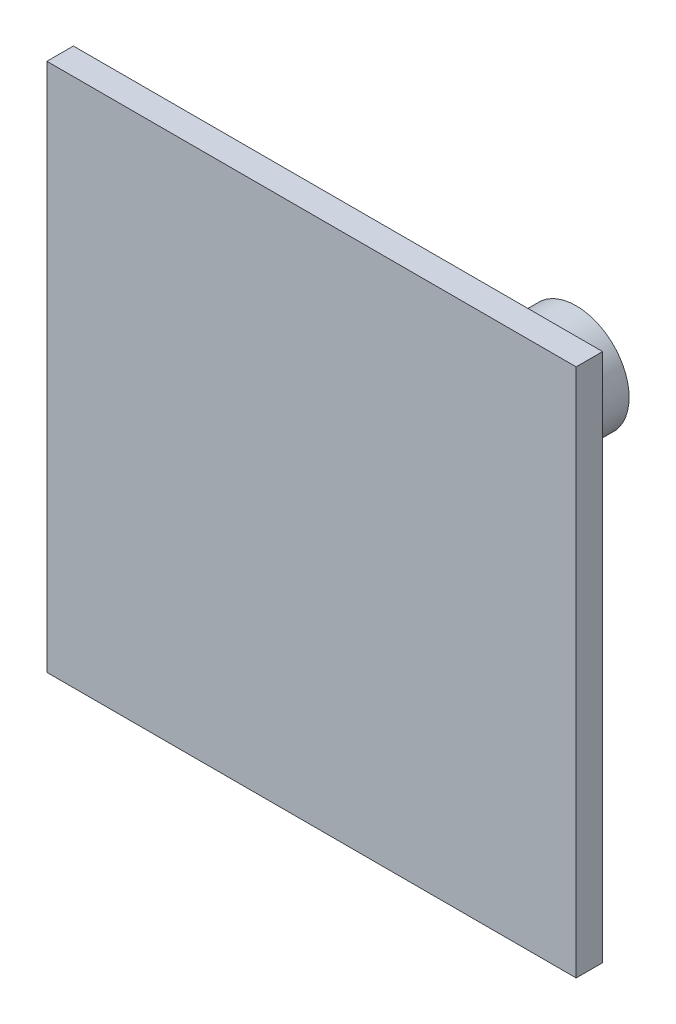
ISO-10303-21;
HEADER;
FILE_DESCRIPTION(('STEP AP214'),'2;1');
FILE_NAME('part.step','',(''),(''),'','','');
FILE_SCHEMA(('AUTOMOTIVE_DESIGN { 1 0 10303 214 1 1 1 1 }'));
ENDSEC;
DATA;
#1=APPLICATION_CONTEXT('core data for automotive mechanical design processes');
#2=APPLICATION_PROTOCOL_DEFINITION('international standard','automotive_design',2000,#1);
#3=PRODUCT_CONTEXT('',#1,'mechanical');
#4=PRODUCT('Part','Part','',(#3));
#5=PRODUCT_RELATED_PRODUCT_CATEGORY('part','',(#4));
#6=PRODUCT_DEFINITION_FORMATION('','',#4);
#7=PRODUCT_DEFINITION_CONTEXT('part definition',#1,'design');
#8=PRODUCT_DEFINITION('design','',#6,#7);
#9=PRODUCT_DEFINITION_SHAPE('','',#8);
#10=(LENGTH_UNIT() NAMED_UNIT(*) SI_UNIT(.MILLI.,.METRE.));
#11=(NAMED_UNIT(*) PLANE_ANGLE_UNIT() SI_UNIT($,.RADIAN.));
#12=(NAMED_UNIT(*) SI_UNIT($,.STERADIAN.) SOLID_ANGLE_UNIT());
#13=UNCERTAINTY_MEASURE_WITH_UNIT(LENGTH_MEASURE(1.E-05),#10,'distance_accuracy_value','');
#14=(GEOMETRIC_REPRESENTATION_CONTEXT(3) GLOBAL_UNCERTAINTY_ASSIGNED_CONTEXT((#13)) GLOBAL_UNIT_ASSIGNED_CONTEXT((#10,
#11,#12)) REPRESENTATION_CONTEXT('',''));
#15=CARTESIAN_POINT('',(0.,0.,0.));
#16=DIRECTION('',(0.,0.,1.));
#17=DIRECTION('',(1.,0.,0.));
#18=AXIS2_PLACEMENT_3D('',#15,#16,#17);
#19=CARTESIAN_POINT('',(-102.425876010782,67.1159029649596,10.));
#20=DIRECTION('',(1.,0.,0.));
#21=DIRECTION('',(0.,1.,0.));
#22=AXIS2_PLACEMENT_3D('',#19,#20,#21);
#23=PLANE('',#22);
#24=DIRECTION('',(0.,-1.,0.));
#25=VECTOR('',#24,1.);
#26=CARTESIAN_POINT('',(-102.425876010782,67.1159029649596,0.));
#27=LINE('',#26,#25);
#28=CARTESIAN_POINT('',(-102.425876010782,67.1159029649596,0.));
#29=VERTEX_POINT('',#28);
#30=CARTESIAN_POINT('',(-102.425876010782,-132.88409703504,0.));
#31=VERTEX_POINT('',#30);
#32=EDGE_CURVE('E110',#29,#31,#27,.T.);
#33=ORIENTED_EDGE('',*,*,#32,.T.);
#34=DIRECTION('',(0.,0.,-1.));
#35=VECTOR('',#34,1.);
#36=CARTESIAN_POINT('',(-102.425876010782,-132.88409703504,10.));
#37=LINE('',#36,#35);
#38=CARTESIAN_POINT('',(-102.425876010782,-132.88409703504,10.));
#39=VERTEX_POINT('',#38);
#40=EDGE_CURVE('E48',#39,#31,#37,.T.);
#41=ORIENTED_EDGE('',*,*,#40,.F.);
#42=DIRECTION('',(0.,-1.,0.));
#43=VECTOR('',#42,1.);
#44=CARTESIAN_POINT('',(-102.425876010782,67.1159029649596,10.));
#45=LINE('',#44,#43);
#46=CARTESIAN_POINT('',(-102.425876010782,67.1159029649596,10.));
#47=VERTEX_POINT('',#46);
#48=EDGE_CURVE('E92',#47,#39,#45,.T.);
#49=ORIENTED_EDGE('',*,*,#48,.F.);
#50=DIRECTION('',(0.,0.,-1.));
#51=VECTOR('',#50,1.);
#52=CARTESIAN_POINT('',(-102.425876010782,67.1159029649596,10.));
#53=LINE('',#52,#51);
#54=EDGE_CURVE('E106',#47,#29,#53,.T.);
#55=ORIENTED_EDGE('',*,*,#54,.T.);
#56=EDGE_LOOP('',(#33,#41,#49,#55));
#57=FACE_BOUND('',#56,.T.);
#58=ADVANCED_FACE('F39',(#57),#23,.F.);
#59=CARTESIAN_POINT('',(-102.425876010782,-132.88409703504,10.));
#60=DIRECTION('',(0.,1.,0.));
#61=DIRECTION('',(0.,0.,1.));
#62=AXIS2_PLACEMENT_3D('',#59,#60,#61);
#63=PLANE('',#62);
#64=DIRECTION('',(1.,0.,0.));
#65=VECTOR('',#64,1.);
#66=CARTESIAN_POINT('',(-102.425876010782,-132.88409703504,0.));
#67=LINE('',#66,#65);
#68=CARTESIAN_POINT('',(97.5741239892183,-132.88409703504,0.));
#69=VERTEX_POINT('',#68);
#70=EDGE_CURVE('E98',#31,#69,#67,.T.);
#71=ORIENTED_EDGE('',*,*,#70,.T.);
#72=DIRECTION('',(0.,0.,-1.));
#73=VECTOR('',#72,1.);
#74=CARTESIAN_POINT('',(97.5741239892183,-132.88409703504,10.));
#75=LINE('',#74,#73);
#76=CARTESIAN_POINT('',(97.5741239892183,-132.88409703504,10.));
#77=VERTEX_POINT('',#76);
#78=EDGE_CURVE('E96',#77,#69,#75,.T.);
#79=ORIENTED_EDGE('',*,*,#78,.F.);
#80=DIRECTION('',(1.,0.,0.));
#81=VECTOR('',#80,1.);
#82=CARTESIAN_POINT('',(-102.425876010782,-132.88409703504,10.));
#83=LINE('',#82,#81);
#84=EDGE_CURVE('E87',#39,#77,#83,.T.);
#85=ORIENTED_EDGE('',*,*,#84,.F.);
#86=ORIENTED_EDGE('',*,*,#40,.T.);
#87=EDGE_LOOP('',(#71,#79,#85,#86));
#88=FACE_BOUND('',#87,.T.);
#89=ADVANCED_FACE('F97',(#88),#63,.F.);
#90=CARTESIAN_POINT('',(97.5741239892183,67.1159029649596,10.));
#91=DIRECTION('',(-1.,0.,0.));
#92=DIRECTION('',(0.,-1.,0.));
#93=AXIS2_PLACEMENT_3D('',#90,#91,#92);
#94=PLANE('',#93);
#95=DIRECTION('',(0.,1.,0.));
#96=VECTOR('',#95,1.);
#97=CARTESIAN_POINT('',(97.5741239892183,67.1159029649596,0.));
#98=LINE('',#97,#96);
#99=CARTESIAN_POINT('',(97.5741239892183,67.1159029649596,0.));
#100=VERTEX_POINT('',#99);
#101=EDGE_CURVE('E73',#69,#100,#98,.T.);
#102=ORIENTED_EDGE('',*,*,#101,.T.);
#103=DIRECTION('',(0.,0.,-1.));
#104=VECTOR('',#103,1.);
#105=CARTESIAN_POINT('',(97.5741239892183,67.1159029649596,10.));
#106=LINE('',#105,#104);
#107=CARTESIAN_POINT('',(97.5741239892183,67.1159029649596,10.));
#108=VERTEX_POINT('',#107);
#109=EDGE_CURVE('E100',#108,#100,#106,.T.);
#110=ORIENTED_EDGE('',*,*,#109,.F.);
#111=DIRECTION('',(0.,1.,0.));
#112=VECTOR('',#111,1.);
#113=CARTESIAN_POINT('',(97.5741239892183,67.1159029649596,10.));
#114=LINE('',#113,#112);
#115=EDGE_CURVE('E90',#77,#108,#114,.T.);
#116=ORIENTED_EDGE('',*,*,#115,.F.);
#117=ORIENTED_EDGE('',*,*,#78,.T.);
#118=EDGE_LOOP('',(#102,#110,#116,#117));
#119=FACE_BOUND('',#118,.T.);
#120=ADVANCED_FACE('F102',(#119),#94,.F.);
#121=CARTESIAN_POINT('',(-102.425876010782,67.1159029649596,10.));
#122=DIRECTION('',(0.,-1.,0.));
#123=DIRECTION('',(0.,0.,-1.));
#124=AXIS2_PLACEMENT_3D('',#121,#122,#123);
#125=PLANE('',#124);
#126=DIRECTION('',(-1.,0.,0.));
#127=VECTOR('',#126,1.);
#128=CARTESIAN_POINT('',(-102.425876010782,67.1159029649596,0.));
#129=LINE('',#128,#127);
#130=EDGE_CURVE('E79',#100,#29,#129,.T.);
#131=ORIENTED_EDGE('',*,*,#130,.T.);
#132=ORIENTED_EDGE('',*,*,#54,.F.);
#133=DIRECTION('',(-1.,0.,0.));
#134=VECTOR('',#133,1.);
#135=CARTESIAN_POINT('',(-102.425876010782,67.1159029649596,10.));
#136=LINE('',#135,#134);
#137=EDGE_CURVE('E56',#108,#47,#136,.T.);
#138=ORIENTED_EDGE('',*,*,#137,.F.);
#139=ORIENTED_EDGE('',*,*,#109,.T.);
#140=EDGE_LOOP('',(#131,#132,#138,#139));
#141=FACE_BOUND('',#140,.T.);
#142=ADVANCED_FACE('F140',(#141),#125,.F.);
#143=CARTESIAN_POINT('',(0.,0.,10.));
#144=DIRECTION('',(0.,0.,1.));
#145=DIRECTION('',(1.,0.,0.));
#146=AXIS2_PLACEMENT_3D('',#143,#144,#145);
#147=PLANE('',#146);
#148=ORIENTED_EDGE('',*,*,#48,.T.);
#149=ORIENTED_EDGE('',*,*,#84,.T.);
#150=ORIENTED_EDGE('',*,*,#115,.T.);
#151=ORIENTED_EDGE('',*,*,#137,.T.);
#152=EDGE_LOOP('',(#148,#149,#150,#151));
#153=FACE_BOUND('',#152,.T.);
#154=ADVANCED_FACE('F88',(#153),#147,.T.);
#155=CARTESIAN_POINT('',(0.,0.,0.));
#156=DIRECTION('',(0.,0.,1.));
#157=DIRECTION('',(1.,0.,0.));
#158=AXIS2_PLACEMENT_3D('',#155,#156,#157);
#159=PLANE('',#158);
#160=CARTESIAN_POINT('',(-2.42587601078172,-32.8840970350404,0.));
#161=DIRECTION('',(0.,0.,1.));
#162=DIRECTION('',(1.,0.,0.));
#163=AXIS2_PLACEMENT_3D('',#160,#161,#162);
#164=CIRCLE('',#163,20.);
#165=CARTESIAN_POINT('',(17.5741239892183,-32.8840970350404,0.));
#166=VERTEX_POINT('',#165);
#167=EDGE_CURVE('E11',#166,#166,#164,.F.);
#168=ORIENTED_EDGE('',*,*,#167,.F.);
#169=EDGE_LOOP('',(#168));
#170=FACE_BOUND('',#169,.T.);
#171=ORIENTED_EDGE('',*,*,#32,.F.);
#172=ORIENTED_EDGE('',*,*,#130,.F.);
#173=ORIENTED_EDGE('',*,*,#101,.F.);
#174=ORIENTED_EDGE('',*,*,#70,.F.);
#175=EDGE_LOOP('',(#171,#172,#173,#174));
#176=FACE_BOUND('',#175,.T.);
#177=ADVANCED_FACE('F128',(#170,#176),#159,.F.);
#178=CARTESIAN_POINT('',(-2.42587601078172,-32.8840970350404,-90.));
#179=DIRECTION('',(0.,0.,1.));
#180=DIRECTION('',(1.,0.,0.));
#181=AXIS2_PLACEMENT_3D('',#178,#179,#180);
#182=CYLINDRICAL_SURFACE('',#181,20.);
#183=CARTESIAN_POINT('',(-2.42587601078172,-32.8840970350404,-90.));
#184=DIRECTION('',(0.,0.,-1.));
#185=DIRECTION('',(-1.,0.,0.));
#186=AXIS2_PLACEMENT_3D('',#183,#184,#185);
#187=CIRCLE('',#186,20.);
#188=CARTESIAN_POINT('',(-22.4258760107817,-32.8840970350404,-90.));
#189=VERTEX_POINT('',#188);
#190=EDGE_CURVE('E114',#189,#189,#187,.T.);
#191=ORIENTED_EDGE('',*,*,#190,.F.);
#192=EDGE_LOOP('',(#191));
#193=FACE_BOUND('',#192,.T.);
#194=ORIENTED_EDGE('',*,*,#167,.T.);
#195=EDGE_LOOP('',(#194));
#196=FACE_BOUND('',#195,.T.);
#197=ADVANCED_FACE('F130',(#193,#196),#182,.T.);
#198=CARTESIAN_POINT('',(-2.42587601078172,-32.8840970350404,-90.));
#199=DIRECTION('',(0.,0.,-1.));
#200=DIRECTION('',(-1.,0.,0.));
#201=AXIS2_PLACEMENT_3D('',#198,#199,#200);
#202=PLANE('',#201);
#203=ORIENTED_EDGE('',*,*,#190,.T.);
#204=EDGE_LOOP('',(#203));
#205=FACE_BOUND('',#204,.T.);
#206=ADVANCED_FACE('F137',(#205),#202,.T.);
#207=CLOSED_SHELL('',(#58,#89,#120,#142,#154,#177,#197,#206));
#208=MANIFOLD_SOLID_BREP('B2',#207);
#209=ADVANCED_BREP_SHAPE_REPRESENTATION('',(#18,#208),#14);
#210=SHAPE_DEFINITION_REPRESENTATION(#9,#209);
ENDSEC;
END-ISO-10303-21;
